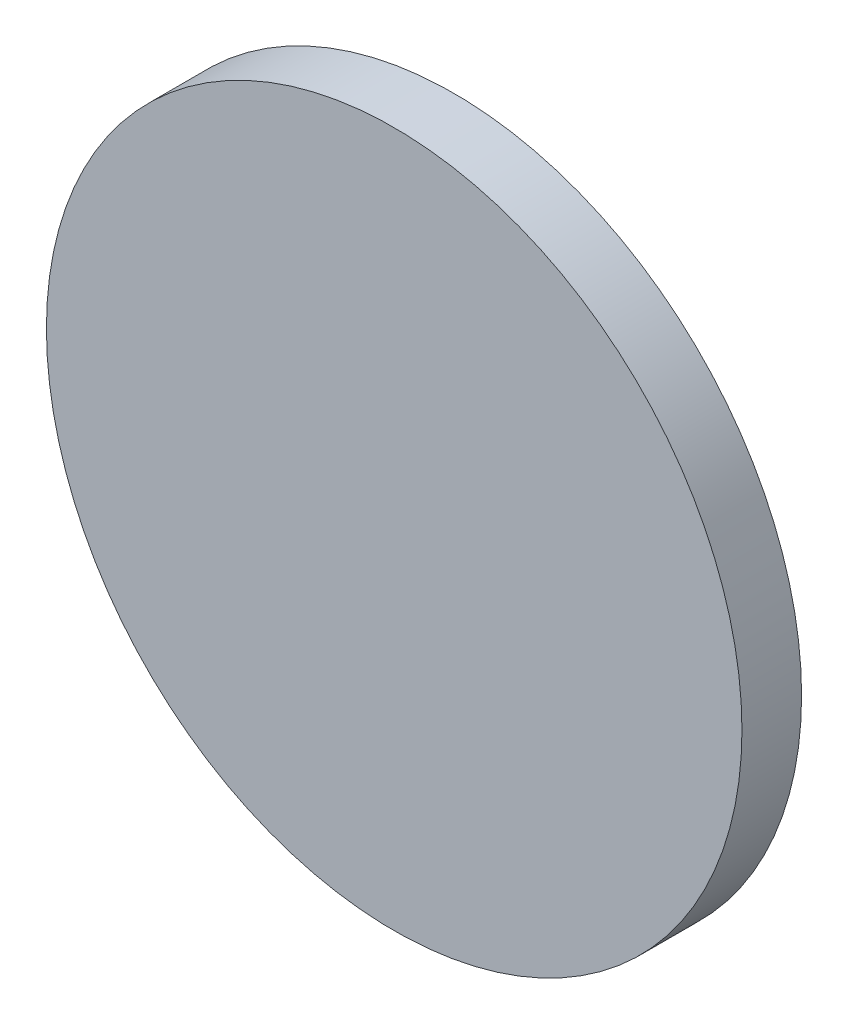
ISO-10303-21;
HEADER;
FILE_DESCRIPTION(('STEP AP214'),'2;1');
FILE_NAME('part.step','',(''),(''),'','','');
FILE_SCHEMA(('AUTOMOTIVE_DESIGN { 1 0 10303 214 1 1 1 1 }'));
ENDSEC;
DATA;
#1=APPLICATION_CONTEXT('core data for automotive mechanical design processes');
#2=APPLICATION_PROTOCOL_DEFINITION('international standard','automotive_design',2000,#1);
#3=PRODUCT_CONTEXT('',#1,'mechanical');
#4=PRODUCT('Part','Part','',(#3));
#5=PRODUCT_RELATED_PRODUCT_CATEGORY('part','',(#4));
#6=PRODUCT_DEFINITION_FORMATION('','',#4);
#7=PRODUCT_DEFINITION_CONTEXT('part definition',#1,'design');
#8=PRODUCT_DEFINITION('design','',#6,#7);
#9=PRODUCT_DEFINITION_SHAPE('','',#8);
#10=(LENGTH_UNIT() NAMED_UNIT(*) SI_UNIT(.MILLI.,.METRE.));
#11=(NAMED_UNIT(*) PLANE_ANGLE_UNIT() SI_UNIT($,.RADIAN.));
#12=(NAMED_UNIT(*) SI_UNIT($,.STERADIAN.) SOLID_ANGLE_UNIT());
#13=UNCERTAINTY_MEASURE_WITH_UNIT(LENGTH_MEASURE(1.E-05),#10,'distance_accuracy_value','');
#14=(GEOMETRIC_REPRESENTATION_CONTEXT(3) GLOBAL_UNCERTAINTY_ASSIGNED_CONTEXT((#13)) GLOBAL_UNIT_ASSIGNED_CONTEXT((#10,
#11,#12)) REPRESENTATION_CONTEXT('',''));
#15=CARTESIAN_POINT('',(0.,0.,0.));
#16=DIRECTION('',(0.,0.,1.));
#17=DIRECTION('',(1.,0.,0.));
#18=AXIS2_PLACEMENT_3D('',#15,#16,#17);
#19=CARTESIAN_POINT('',(1.7653,4.264660006176,0.79916));
#20=DIRECTION('',(0.,0.,1.));
#21=DIRECTION('',(1.,0.,0.));
#22=AXIS2_PLACEMENT_3D('',#19,#20,#21);
#23=PLANE('',#22);
#24=CARTESIAN_POINT('',(1.7653,4.264660006176,0.79916));
#25=DIRECTION('',(0.,0.,1.));
#26=DIRECTION('',(1.,0.,0.));
#27=AXIS2_PLACEMENT_3D('',#24,#25,#26);
#28=CIRCLE('',#27,0.200024667);
#29=CARTESIAN_POINT('',(1.965324667,4.264660006176,0.79916));
#30=VERTEX_POINT('',#29);
#31=EDGE_CURVE('E18',#30,#30,#28,.F.);
#32=ORIENTED_EDGE('',*,*,#31,.F.);
#33=EDGE_LOOP('',(#32));
#34=FACE_BOUND('',#33,.T.);
#35=ADVANCED_FACE('F15',(#34),#23,.T.);
#36=CARTESIAN_POINT('',(1.7653,4.264660006176,0.76487));
#37=DIRECTION('',(0.,0.,1.));
#38=DIRECTION('',(1.,0.,0.));
#39=AXIS2_PLACEMENT_3D('',#36,#37,#38);
#40=CYLINDRICAL_SURFACE('',#39,0.200024667);
#41=ORIENTED_EDGE('',*,*,#31,.T.);
#42=EDGE_LOOP('',(#41));
#43=FACE_BOUND('',#42,.T.);
#44=CARTESIAN_POINT('',(1.7653,4.264660006176,0.76487));
#45=DIRECTION('',(0.,0.,1.));
#46=DIRECTION('',(1.,0.,0.));
#47=AXIS2_PLACEMENT_3D('',#44,#45,#46);
#48=CIRCLE('',#47,0.200024667);
#49=CARTESIAN_POINT('',(1.965324667,4.264660006176,0.76487));
#50=VERTEX_POINT('',#49);
#51=EDGE_CURVE('E10',#50,#50,#48,.F.);
#52=ORIENTED_EDGE('',*,*,#51,.F.);
#53=EDGE_LOOP('',(#52));
#54=FACE_BOUND('',#53,.T.);
#55=ADVANCED_FACE('F27',(#43,#54),#40,.T.);
#56=CARTESIAN_POINT('',(1.7653,4.264660006176,0.76487));
#57=DIRECTION('',(0.,0.,-1.));
#58=DIRECTION('',(-1.,0.,0.));
#59=AXIS2_PLACEMENT_3D('',#56,#57,#58);
#60=PLANE('',#59);
#61=ORIENTED_EDGE('',*,*,#51,.T.);
#62=EDGE_LOOP('',(#61));
#63=FACE_BOUND('',#62,.T.);
#64=ADVANCED_FACE('F35',(#63),#60,.T.);
#65=CLOSED_SHELL('',(#35,#55,#64));
#66=MANIFOLD_SOLID_BREP('B1',#65);
#67=ADVANCED_BREP_SHAPE_REPRESENTATION('',(#18,#66),#14);
#68=SHAPE_DEFINITION_REPRESENTATION(#9,#67);
ENDSEC;
END-ISO-10303-21;
